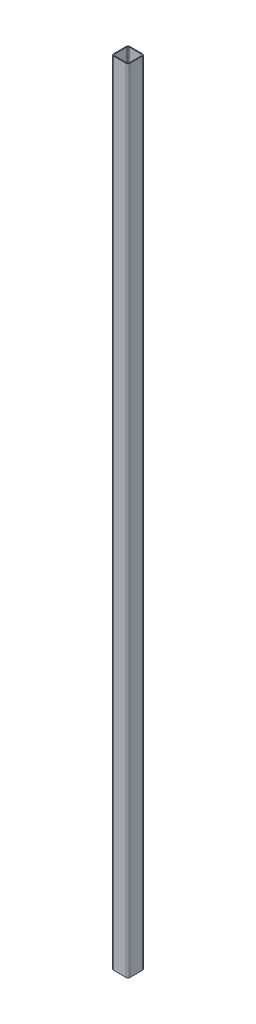
ISO-10303-21;
HEADER;
FILE_DESCRIPTION(('STEP AP214'),'2;1');
FILE_NAME('part.step','',(''),(''),'','','');
FILE_SCHEMA(('AUTOMOTIVE_DESIGN { 1 0 10303 214 1 1 1 1 }'));
ENDSEC;
DATA;
#1=APPLICATION_CONTEXT('core data for automotive mechanical design processes');
#2=APPLICATION_PROTOCOL_DEFINITION('international standard','automotive_design',2000,#1);
#3=PRODUCT_CONTEXT('',#1,'mechanical');
#4=PRODUCT('Part','Part','',(#3));
#5=PRODUCT_RELATED_PRODUCT_CATEGORY('part','',(#4));
#6=PRODUCT_DEFINITION_FORMATION('','',#4);
#7=PRODUCT_DEFINITION_CONTEXT('part definition',#1,'design');
#8=PRODUCT_DEFINITION('design','',#6,#7);
#9=PRODUCT_DEFINITION_SHAPE('','',#8);
#10=(LENGTH_UNIT() NAMED_UNIT(*) SI_UNIT(.MILLI.,.METRE.));
#11=(NAMED_UNIT(*) PLANE_ANGLE_UNIT() SI_UNIT($,.RADIAN.));
#12=(NAMED_UNIT(*) SI_UNIT($,.STERADIAN.) SOLID_ANGLE_UNIT());
#13=UNCERTAINTY_MEASURE_WITH_UNIT(LENGTH_MEASURE(1.E-05),#10,'distance_accuracy_value','');
#14=(GEOMETRIC_REPRESENTATION_CONTEXT(3) GLOBAL_UNCERTAINTY_ASSIGNED_CONTEXT((#13)) GLOBAL_UNIT_ASSIGNED_CONTEXT((#10,
#11,#12)) REPRESENTATION_CONTEXT('',''));
#15=CARTESIAN_POINT('',(0.,0.,0.));
#16=DIRECTION('',(0.,0.,1.));
#17=DIRECTION('',(1.,0.,0.));
#18=AXIS2_PLACEMENT_3D('',#15,#16,#17);
#19=CARTESIAN_POINT('',(-15.5,0.,-1064.5));
#20=DIRECTION('',(0.,1.,0.));
#21=DIRECTION('',(0.,0.,1.));
#22=AXIS2_PLACEMENT_3D('',#19,#20,#21);
#23=CYLINDRICAL_SURFACE('',#22,4.5);
#24=CARTESIAN_POINT('',(-15.5,1940.,-1064.5));
#25=DIRECTION('',(0.,1.,0.));
#26=DIRECTION('',(0.,0.,1.));
#27=AXIS2_PLACEMENT_3D('',#24,#25,#26);
#28=CIRCLE('',#27,4.5);
#29=CARTESIAN_POINT('',(-20.,1940.,-1064.5));
#30=VERTEX_POINT('',#29);
#31=CARTESIAN_POINT('',(-15.5,1940.,-1060.));
#32=VERTEX_POINT('',#31);
#33=EDGE_CURVE('E267',#30,#32,#28,.T.);
#34=ORIENTED_EDGE('',*,*,#33,.F.);
#35=DIRECTION('',(0.,1.,0.));
#36=VECTOR('',#35,1.);
#37=CARTESIAN_POINT('',(-20.,0.,-1064.5));
#38=LINE('',#37,#36);
#39=CARTESIAN_POINT('',(-20.,20.,-1064.5));
#40=VERTEX_POINT('',#39);
#41=EDGE_CURVE('E189',#40,#30,#38,.T.);
#42=ORIENTED_EDGE('',*,*,#41,.F.);
#43=CARTESIAN_POINT('',(-15.5,20.,-1064.5));
#44=DIRECTION('',(0.,-1.,0.));
#45=DIRECTION('',(0.,0.,-1.));
#46=AXIS2_PLACEMENT_3D('',#43,#44,#45);
#47=CIRCLE('',#46,4.5);
#48=CARTESIAN_POINT('',(-15.5,20.,-1060.));
#49=VERTEX_POINT('',#48);
#50=EDGE_CURVE('E299',#49,#40,#47,.T.);
#51=ORIENTED_EDGE('',*,*,#50,.F.);
#52=DIRECTION('',(0.,1.,0.));
#53=VECTOR('',#52,1.);
#54=CARTESIAN_POINT('',(-15.5,0.,-1060.));
#55=LINE('',#54,#53);
#56=EDGE_CURVE('E177',#49,#32,#55,.T.);
#57=ORIENTED_EDGE('',*,*,#56,.T.);
#58=EDGE_LOOP('',(#34,#42,#51,#57));
#59=FACE_BOUND('',#58,.T.);
#60=ADVANCED_FACE('F39',(#59),#23,.T.);
#61=CARTESIAN_POINT('',(-20.,0.,-1064.5));
#62=DIRECTION('',(1.,0.,0.));
#63=DIRECTION('',(0.,0.,-1.));
#64=AXIS2_PLACEMENT_3D('',#61,#62,#63);
#65=PLANE('',#64);
#66=DIRECTION('',(0.,0.,-1.));
#67=VECTOR('',#66,1.);
#68=CARTESIAN_POINT('',(-20.,1940.,0.));
#69=LINE('',#68,#67);
#70=CARTESIAN_POINT('',(-20.,1940.,-1095.5));
#71=VERTEX_POINT('',#70);
#72=EDGE_CURVE('E53',#30,#71,#69,.T.);
#73=ORIENTED_EDGE('',*,*,#72,.T.);
#74=DIRECTION('',(0.,1.,0.));
#75=VECTOR('',#74,1.);
#76=CARTESIAN_POINT('',(-20.,0.,-1095.5));
#77=LINE('',#76,#75);
#78=CARTESIAN_POINT('',(-20.,20.,-1095.5));
#79=VERTEX_POINT('',#78);
#80=EDGE_CURVE('E186',#79,#71,#77,.T.);
#81=ORIENTED_EDGE('',*,*,#80,.F.);
#82=DIRECTION('',(0.,0.,1.));
#83=VECTOR('',#82,1.);
#84=CARTESIAN_POINT('',(-20.,20.,-3240.));
#85=LINE('',#84,#83);
#86=EDGE_CURVE('E277',#79,#40,#85,.T.);
#87=ORIENTED_EDGE('',*,*,#86,.T.);
#88=ORIENTED_EDGE('',*,*,#41,.T.);
#89=EDGE_LOOP('',(#73,#81,#87,#88));
#90=FACE_BOUND('',#89,.T.);
#91=ADVANCED_FACE('F314',(#90),#65,.F.);
#92=CARTESIAN_POINT('',(-15.5,0.,-1095.5));
#93=DIRECTION('',(0.,1.,0.));
#94=DIRECTION('',(0.,0.,1.));
#95=AXIS2_PLACEMENT_3D('',#92,#93,#94);
#96=CYLINDRICAL_SURFACE('',#95,4.5);
#97=CARTESIAN_POINT('',(-15.5,1940.,-1095.5));
#98=DIRECTION('',(0.,1.,0.));
#99=DIRECTION('',(0.,0.,1.));
#100=AXIS2_PLACEMENT_3D('',#97,#98,#99);
#101=CIRCLE('',#100,4.5);
#102=CARTESIAN_POINT('',(-15.5,1940.,-1100.));
#103=VERTEX_POINT('',#102);
#104=EDGE_CURVE('E159',#103,#71,#101,.T.);
#105=ORIENTED_EDGE('',*,*,#104,.F.);
#106=DIRECTION('',(0.,1.,0.));
#107=VECTOR('',#106,1.);
#108=CARTESIAN_POINT('',(-15.5,0.,-1100.));
#109=LINE('',#108,#107);
#110=CARTESIAN_POINT('',(-15.5,20.,-1100.));
#111=VERTEX_POINT('',#110);
#112=EDGE_CURVE('E183',#111,#103,#109,.T.);
#113=ORIENTED_EDGE('',*,*,#112,.F.);
#114=CARTESIAN_POINT('',(-15.5,20.,-1095.5));
#115=DIRECTION('',(0.,-1.,0.));
#116=DIRECTION('',(0.,0.,-1.));
#117=AXIS2_PLACEMENT_3D('',#114,#115,#116);
#118=CIRCLE('',#117,4.5);
#119=EDGE_CURVE('E209',#79,#111,#118,.T.);
#120=ORIENTED_EDGE('',*,*,#119,.F.);
#121=ORIENTED_EDGE('',*,*,#80,.T.);
#122=EDGE_LOOP('',(#105,#113,#120,#121));
#123=FACE_BOUND('',#122,.T.);
#124=ADVANCED_FACE('F311',(#123),#96,.T.);
#125=CARTESIAN_POINT('',(-15.5,0.,-1100.));
#126=DIRECTION('',(0.,0.,1.));
#127=DIRECTION('',(1.,0.,0.));
#128=AXIS2_PLACEMENT_3D('',#125,#126,#127);
#129=PLANE('',#128);
#130=DIRECTION('',(-1.,0.,0.));
#131=VECTOR('',#130,1.);
#132=CARTESIAN_POINT('',(-15.5,1940.,-1100.));
#133=LINE('',#132,#131);
#134=CARTESIAN_POINT('',(15.5,1940.,-1100.));
#135=VERTEX_POINT('',#134);
#136=EDGE_CURVE('E271',#135,#103,#133,.T.);
#137=ORIENTED_EDGE('',*,*,#136,.F.);
#138=DIRECTION('',(0.,1.,0.));
#139=VECTOR('',#138,1.);
#140=CARTESIAN_POINT('',(15.5,0.,-1100.));
#141=LINE('',#140,#139);
#142=CARTESIAN_POINT('',(15.5,20.,-1100.));
#143=VERTEX_POINT('',#142);
#144=EDGE_CURVE('E175',#143,#135,#141,.T.);
#145=ORIENTED_EDGE('',*,*,#144,.F.);
#146=DIRECTION('',(1.,0.,0.));
#147=VECTOR('',#146,1.);
#148=CARTESIAN_POINT('',(-15.5,20.,-1100.));
#149=LINE('',#148,#147);
#150=EDGE_CURVE('E213',#111,#143,#149,.T.);
#151=ORIENTED_EDGE('',*,*,#150,.F.);
#152=ORIENTED_EDGE('',*,*,#112,.T.);
#153=EDGE_LOOP('',(#137,#145,#151,#152));
#154=FACE_BOUND('',#153,.T.);
#155=ADVANCED_FACE('F308',(#154),#129,.F.);
#156=CARTESIAN_POINT('',(15.5,0.,-1095.5));
#157=DIRECTION('',(0.,1.,0.));
#158=DIRECTION('',(0.,0.,1.));
#159=AXIS2_PLACEMENT_3D('',#156,#157,#158);
#160=CYLINDRICAL_SURFACE('',#159,4.5);
#161=CARTESIAN_POINT('',(15.5,1940.,-1095.5));
#162=DIRECTION('',(0.,1.,0.));
#163=DIRECTION('',(0.,0.,1.));
#164=AXIS2_PLACEMENT_3D('',#161,#162,#163);
#165=CIRCLE('',#164,4.5);
#166=CARTESIAN_POINT('',(20.,1940.,-1095.5));
#167=VERTEX_POINT('',#166);
#168=EDGE_CURVE('E273',#167,#135,#165,.T.);
#169=ORIENTED_EDGE('',*,*,#168,.F.);
#170=DIRECTION('',(0.,1.,0.));
#171=VECTOR('',#170,1.);
#172=CARTESIAN_POINT('',(20.,0.,-1095.5));
#173=LINE('',#172,#171);
#174=CARTESIAN_POINT('',(20.,20.,-1095.5));
#175=VERTEX_POINT('',#174);
#176=EDGE_CURVE('E168',#175,#167,#173,.T.);
#177=ORIENTED_EDGE('',*,*,#176,.F.);
#178=CARTESIAN_POINT('',(15.5,20.,-1095.5));
#179=DIRECTION('',(0.,-1.,0.));
#180=DIRECTION('',(0.,0.,-1.));
#181=AXIS2_PLACEMENT_3D('',#178,#179,#180);
#182=CIRCLE('',#181,4.5);
#183=EDGE_CURVE('E218',#143,#175,#182,.T.);
#184=ORIENTED_EDGE('',*,*,#183,.F.);
#185=ORIENTED_EDGE('',*,*,#144,.T.);
#186=EDGE_LOOP('',(#169,#177,#184,#185));
#187=FACE_BOUND('',#186,.T.);
#188=ADVANCED_FACE('F304',(#187),#160,.T.);
#189=CARTESIAN_POINT('',(20.,0.,-1064.5));
#190=DIRECTION('',(-1.,0.,0.));
#191=DIRECTION('',(0.,0.,1.));
#192=AXIS2_PLACEMENT_3D('',#189,#190,#191);
#193=PLANE('',#192);
#194=DIRECTION('',(0.,0.,-1.));
#195=VECTOR('',#194,1.);
#196=CARTESIAN_POINT('',(20.,1940.,0.));
#197=LINE('',#196,#195);
#198=CARTESIAN_POINT('',(20.,1940.,-1064.5));
#199=VERTEX_POINT('',#198);
#200=EDGE_CURVE('E151',#199,#167,#197,.T.);
#201=ORIENTED_EDGE('',*,*,#200,.F.);
#202=DIRECTION('',(0.,1.,0.));
#203=VECTOR('',#202,1.);
#204=CARTESIAN_POINT('',(20.,0.,-1064.5));
#205=LINE('',#204,#203);
#206=CARTESIAN_POINT('',(20.,20.,-1064.5));
#207=VERTEX_POINT('',#206);
#208=EDGE_CURVE('E166',#207,#199,#205,.T.);
#209=ORIENTED_EDGE('',*,*,#208,.F.);
#210=DIRECTION('',(0.,0.,1.));
#211=VECTOR('',#210,1.);
#212=CARTESIAN_POINT('',(20.,20.,-3240.));
#213=LINE('',#212,#211);
#214=EDGE_CURVE('E275',#175,#207,#213,.T.);
#215=ORIENTED_EDGE('',*,*,#214,.F.);
#216=ORIENTED_EDGE('',*,*,#176,.T.);
#217=EDGE_LOOP('',(#201,#209,#215,#216));
#218=FACE_BOUND('',#217,.T.);
#219=ADVANCED_FACE('F164',(#218),#193,.F.);
#220=CARTESIAN_POINT('',(15.5,0.,-1064.5));
#221=DIRECTION('',(0.,1.,0.));
#222=DIRECTION('',(0.,0.,1.));
#223=AXIS2_PLACEMENT_3D('',#220,#221,#222);
#224=CYLINDRICAL_SURFACE('',#223,4.5);
#225=CARTESIAN_POINT('',(15.5,1940.,-1064.5));
#226=DIRECTION('',(0.,1.,0.));
#227=DIRECTION('',(0.,0.,1.));
#228=AXIS2_PLACEMENT_3D('',#225,#226,#227);
#229=CIRCLE('',#228,4.5);
#230=CARTESIAN_POINT('',(15.5,1940.,-1060.));
#231=VERTEX_POINT('',#230);
#232=EDGE_CURVE('E148',#231,#199,#229,.T.);
#233=ORIENTED_EDGE('',*,*,#232,.F.);
#234=DIRECTION('',(0.,1.,0.));
#235=VECTOR('',#234,1.);
#236=CARTESIAN_POINT('',(15.5,0.,-1060.));
#237=LINE('',#236,#235);
#238=CARTESIAN_POINT('',(15.5,20.,-1060.));
#239=VERTEX_POINT('',#238);
#240=EDGE_CURVE('E173',#239,#231,#237,.T.);
#241=ORIENTED_EDGE('',*,*,#240,.F.);
#242=CARTESIAN_POINT('',(15.5,20.,-1064.5));
#243=DIRECTION('',(0.,-1.,0.));
#244=DIRECTION('',(0.,0.,-1.));
#245=AXIS2_PLACEMENT_3D('',#242,#243,#244);
#246=CIRCLE('',#245,4.5);
#247=EDGE_CURVE('E172',#207,#239,#246,.T.);
#248=ORIENTED_EDGE('',*,*,#247,.F.);
#249=ORIENTED_EDGE('',*,*,#208,.T.);
#250=EDGE_LOOP('',(#233,#241,#248,#249));
#251=FACE_BOUND('',#250,.T.);
#252=ADVANCED_FACE('F171',(#251),#224,.T.);
#253=CARTESIAN_POINT('',(-15.5,0.,-1060.));
#254=DIRECTION('',(0.,0.,-1.));
#255=DIRECTION('',(-1.,0.,0.));
#256=AXIS2_PLACEMENT_3D('',#253,#254,#255);
#257=PLANE('',#256);
#258=DIRECTION('',(1.,0.,0.));
#259=VECTOR('',#258,1.);
#260=CARTESIAN_POINT('',(-15.5,1940.,-1060.));
#261=LINE('',#260,#259);
#262=EDGE_CURVE('E154',#32,#231,#261,.T.);
#263=ORIENTED_EDGE('',*,*,#262,.F.);
#264=ORIENTED_EDGE('',*,*,#56,.F.);
#265=DIRECTION('',(-1.,0.,0.));
#266=VECTOR('',#265,1.);
#267=CARTESIAN_POINT('',(-15.5,20.,-1060.));
#268=LINE('',#267,#266);
#269=EDGE_CURVE('E296',#239,#49,#268,.T.);
#270=ORIENTED_EDGE('',*,*,#269,.F.);
#271=ORIENTED_EDGE('',*,*,#240,.T.);
#272=EDGE_LOOP('',(#263,#264,#270,#271));
#273=FACE_BOUND('',#272,.T.);
#274=ADVANCED_FACE('F317',(#273),#257,.F.);
#275=CARTESIAN_POINT('',(-15.5,20.,-3240.));
#276=DIRECTION('',(0.,-1.,0.));
#277=DIRECTION('',(0.,0.,-1.));
#278=AXIS2_PLACEMENT_3D('',#275,#276,#277);
#279=PLANE('',#278);
#280=DIRECTION('',(-1.,0.,0.));
#281=VECTOR('',#280,1.);
#282=CARTESIAN_POINT('',(-15.,20.,-1062.));
#283=LINE('',#282,#281);
#284=CARTESIAN_POINT('',(15.,20.,-1062.));
#285=VERTEX_POINT('',#284);
#286=CARTESIAN_POINT('',(-15.,20.,-1062.));
#287=VERTEX_POINT('',#286);
#288=EDGE_CURVE('E291',#285,#287,#283,.T.);
#289=ORIENTED_EDGE('',*,*,#288,.F.);
#290=CARTESIAN_POINT('',(15.,20.,-1065.));
#291=DIRECTION('',(0.,-1.,0.));
#292=DIRECTION('',(0.,0.,-1.));
#293=AXIS2_PLACEMENT_3D('',#290,#291,#292);
#294=CIRCLE('',#293,3.);
#295=CARTESIAN_POINT('',(18.,20.,-1065.));
#296=VERTEX_POINT('',#295);
#297=EDGE_CURVE('E247',#296,#285,#294,.T.);
#298=ORIENTED_EDGE('',*,*,#297,.F.);
#299=DIRECTION('',(0.,0.,1.));
#300=VECTOR('',#299,1.);
#301=CARTESIAN_POINT('',(18.,20.,-1065.));
#302=LINE('',#301,#300);
#303=CARTESIAN_POINT('',(18.,20.,-1095.));
#304=VERTEX_POINT('',#303);
#305=EDGE_CURVE('E242',#304,#296,#302,.T.);
#306=ORIENTED_EDGE('',*,*,#305,.F.);
#307=CARTESIAN_POINT('',(15.,20.,-1095.));
#308=DIRECTION('',(0.,-1.,0.));
#309=DIRECTION('',(0.,0.,-1.));
#310=AXIS2_PLACEMENT_3D('',#307,#308,#309);
#311=CIRCLE('',#310,3.);
#312=CARTESIAN_POINT('',(15.,20.,-1098.));
#313=VERTEX_POINT('',#312);
#314=EDGE_CURVE('E286',#313,#304,#311,.T.);
#315=ORIENTED_EDGE('',*,*,#314,.F.);
#316=DIRECTION('',(1.,0.,0.));
#317=VECTOR('',#316,1.);
#318=CARTESIAN_POINT('',(-15.,20.,-1098.));
#319=LINE('',#318,#317);
#320=CARTESIAN_POINT('',(-15.,20.,-1098.));
#321=VERTEX_POINT('',#320);
#322=EDGE_CURVE('E283',#321,#313,#319,.T.);
#323=ORIENTED_EDGE('',*,*,#322,.F.);
#324=CARTESIAN_POINT('',(-15.,20.,-1095.));
#325=DIRECTION('',(0.,-1.,0.));
#326=DIRECTION('',(0.,0.,-1.));
#327=AXIS2_PLACEMENT_3D('',#324,#325,#326);
#328=CIRCLE('',#327,3.);
#329=CARTESIAN_POINT('',(-18.,20.,-1095.));
#330=VERTEX_POINT('',#329);
#331=EDGE_CURVE('E280',#330,#321,#328,.T.);
#332=ORIENTED_EDGE('',*,*,#331,.F.);
#333=DIRECTION('',(0.,0.,-1.));
#334=VECTOR('',#333,1.);
#335=CARTESIAN_POINT('',(-18.,20.,-1065.));
#336=LINE('',#335,#334);
#337=CARTESIAN_POINT('',(-18.,20.,-1065.));
#338=VERTEX_POINT('',#337);
#339=EDGE_CURVE('E46',#338,#330,#336,.T.);
#340=ORIENTED_EDGE('',*,*,#339,.F.);
#341=CARTESIAN_POINT('',(-15.,20.,-1065.));
#342=DIRECTION('',(0.,-1.,0.));
#343=DIRECTION('',(0.,0.,-1.));
#344=AXIS2_PLACEMENT_3D('',#341,#342,#343);
#345=CIRCLE('',#344,3.);
#346=EDGE_CURVE('E293',#287,#338,#345,.T.);
#347=ORIENTED_EDGE('',*,*,#346,.F.);
#348=EDGE_LOOP('',(#289,#298,#306,#315,#323,#332,#340,#347));
#349=FACE_BOUND('',#348,.T.);
#350=ORIENTED_EDGE('',*,*,#119,.T.);
#351=ORIENTED_EDGE('',*,*,#150,.T.);
#352=ORIENTED_EDGE('',*,*,#183,.T.);
#353=ORIENTED_EDGE('',*,*,#214,.T.);
#354=ORIENTED_EDGE('',*,*,#247,.T.);
#355=ORIENTED_EDGE('',*,*,#269,.T.);
#356=ORIENTED_EDGE('',*,*,#50,.T.);
#357=ORIENTED_EDGE('',*,*,#86,.F.);
#358=EDGE_LOOP('',(#350,#351,#352,#353,#354,#355,#356,#357));
#359=FACE_BOUND('',#358,.T.);
#360=ADVANCED_FACE('F301',(#349,#359),#279,.T.);
#361=CARTESIAN_POINT('',(-15.,0.,-1065.));
#362=DIRECTION('',(0.,1.,0.));
#363=DIRECTION('',(0.,0.,1.));
#364=AXIS2_PLACEMENT_3D('',#361,#362,#363);
#365=CYLINDRICAL_SURFACE('',#364,3.);
#366=DIRECTION('',(0.,1.,0.));
#367=VECTOR('',#366,1.);
#368=CARTESIAN_POINT('',(-18.,0.,-1065.));
#369=LINE('',#368,#367);
#370=CARTESIAN_POINT('',(-18.,1940.,-1065.));
#371=VERTEX_POINT('',#370);
#372=EDGE_CURVE('E191',#338,#371,#369,.T.);
#373=ORIENTED_EDGE('',*,*,#372,.T.);
#374=CARTESIAN_POINT('',(-15.,1940.,-1065.));
#375=DIRECTION('',(0.,1.,0.));
#376=DIRECTION('',(0.,0.,1.));
#377=AXIS2_PLACEMENT_3D('',#374,#375,#376);
#378=CIRCLE('',#377,3.);
#379=CARTESIAN_POINT('',(-15.,1940.,-1062.));
#380=VERTEX_POINT('',#379);
#381=EDGE_CURVE('E11',#371,#380,#378,.T.);
#382=ORIENTED_EDGE('',*,*,#381,.T.);
#383=DIRECTION('',(0.,1.,0.));
#384=VECTOR('',#383,1.);
#385=CARTESIAN_POINT('',(-15.,0.,-1062.));
#386=LINE('',#385,#384);
#387=EDGE_CURVE('E193',#287,#380,#386,.T.);
#388=ORIENTED_EDGE('',*,*,#387,.F.);
#389=ORIENTED_EDGE('',*,*,#346,.T.);
#390=EDGE_LOOP('',(#373,#382,#388,#389));
#391=FACE_BOUND('',#390,.T.);
#392=ADVANCED_FACE('F326',(#391),#365,.F.);
#393=CARTESIAN_POINT('',(-15.,0.,-1062.));
#394=DIRECTION('',(0.,0.,-1.));
#395=DIRECTION('',(-1.,0.,0.));
#396=AXIS2_PLACEMENT_3D('',#393,#394,#395);
#397=PLANE('',#396);
#398=ORIENTED_EDGE('',*,*,#387,.T.);
#399=DIRECTION('',(1.,0.,0.));
#400=VECTOR('',#399,1.);
#401=CARTESIAN_POINT('',(-15.,1940.,-1062.));
#402=LINE('',#401,#400);
#403=CARTESIAN_POINT('',(15.,1940.,-1062.));
#404=VERTEX_POINT('',#403);
#405=EDGE_CURVE('E61',#380,#404,#402,.T.);
#406=ORIENTED_EDGE('',*,*,#405,.T.);
#407=DIRECTION('',(0.,1.,0.));
#408=VECTOR('',#407,1.);
#409=CARTESIAN_POINT('',(15.,0.,-1062.));
#410=LINE('',#409,#408);
#411=EDGE_CURVE('E199',#285,#404,#410,.T.);
#412=ORIENTED_EDGE('',*,*,#411,.F.);
#413=ORIENTED_EDGE('',*,*,#288,.T.);
#414=EDGE_LOOP('',(#398,#406,#412,#413));
#415=FACE_BOUND('',#414,.T.);
#416=ADVANCED_FACE('F391',(#415),#397,.T.);
#417=CARTESIAN_POINT('',(15.,0.,-1065.));
#418=DIRECTION('',(0.,1.,0.));
#419=DIRECTION('',(0.,0.,1.));
#420=AXIS2_PLACEMENT_3D('',#417,#418,#419);
#421=CYLINDRICAL_SURFACE('',#420,3.);
#422=ORIENTED_EDGE('',*,*,#411,.T.);
#423=CARTESIAN_POINT('',(15.,1940.,-1065.));
#424=DIRECTION('',(0.,1.,0.));
#425=DIRECTION('',(0.,0.,1.));
#426=AXIS2_PLACEMENT_3D('',#423,#424,#425);
#427=CIRCLE('',#426,3.);
#428=CARTESIAN_POINT('',(18.,1940.,-1065.));
#429=VERTEX_POINT('',#428);
#430=EDGE_CURVE('E249',#404,#429,#427,.T.);
#431=ORIENTED_EDGE('',*,*,#430,.T.);
#432=DIRECTION('',(0.,1.,0.));
#433=VECTOR('',#432,1.);
#434=CARTESIAN_POINT('',(18.,0.,-1065.));
#435=LINE('',#434,#433);
#436=EDGE_CURVE('E205',#296,#429,#435,.T.);
#437=ORIENTED_EDGE('',*,*,#436,.F.);
#438=ORIENTED_EDGE('',*,*,#297,.T.);
#439=EDGE_LOOP('',(#422,#431,#437,#438));
#440=FACE_BOUND('',#439,.T.);
#441=ADVANCED_FACE('F246',(#440),#421,.F.);
#442=CARTESIAN_POINT('',(18.,0.,-1065.));
#443=DIRECTION('',(-1.,0.,0.));
#444=DIRECTION('',(0.,0.,1.));
#445=AXIS2_PLACEMENT_3D('',#442,#443,#444);
#446=PLANE('',#445);
#447=ORIENTED_EDGE('',*,*,#436,.T.);
#448=DIRECTION('',(0.,0.,-1.));
#449=VECTOR('',#448,1.);
#450=CARTESIAN_POINT('',(18.,1940.,-1065.));
#451=LINE('',#450,#449);
#452=CARTESIAN_POINT('',(18.,1940.,-1095.));
#453=VERTEX_POINT('',#452);
#454=EDGE_CURVE('E241',#429,#453,#451,.T.);
#455=ORIENTED_EDGE('',*,*,#454,.T.);
#456=DIRECTION('',(0.,1.,0.));
#457=VECTOR('',#456,1.);
#458=CARTESIAN_POINT('',(18.,0.,-1095.));
#459=LINE('',#458,#457);
#460=EDGE_CURVE('E232',#304,#453,#459,.T.);
#461=ORIENTED_EDGE('',*,*,#460,.F.);
#462=ORIENTED_EDGE('',*,*,#305,.T.);
#463=EDGE_LOOP('',(#447,#455,#461,#462));
#464=FACE_BOUND('',#463,.T.);
#465=ADVANCED_FACE('F239',(#464),#446,.T.);
#466=CARTESIAN_POINT('',(15.,0.,-1095.));
#467=DIRECTION('',(0.,1.,0.));
#468=DIRECTION('',(0.,0.,1.));
#469=AXIS2_PLACEMENT_3D('',#466,#467,#468);
#470=CYLINDRICAL_SURFACE('',#469,3.);
#471=ORIENTED_EDGE('',*,*,#460,.T.);
#472=CARTESIAN_POINT('',(15.,1940.,-1095.));
#473=DIRECTION('',(0.,1.,0.));
#474=DIRECTION('',(0.,0.,1.));
#475=AXIS2_PLACEMENT_3D('',#472,#473,#474);
#476=CIRCLE('',#475,3.);
#477=CARTESIAN_POINT('',(15.,1940.,-1098.));
#478=VERTEX_POINT('',#477);
#479=EDGE_CURVE('E251',#453,#478,#476,.T.);
#480=ORIENTED_EDGE('',*,*,#479,.T.);
#481=DIRECTION('',(0.,1.,0.));
#482=VECTOR('',#481,1.);
#483=CARTESIAN_POINT('',(15.,0.,-1098.));
#484=LINE('',#483,#482);
#485=EDGE_CURVE('E229',#313,#478,#484,.T.);
#486=ORIENTED_EDGE('',*,*,#485,.F.);
#487=ORIENTED_EDGE('',*,*,#314,.T.);
#488=EDGE_LOOP('',(#471,#480,#486,#487));
#489=FACE_BOUND('',#488,.T.);
#490=ADVANCED_FACE('F410',(#489),#470,.F.);
#491=CARTESIAN_POINT('',(-15.,0.,-1098.));
#492=DIRECTION('',(0.,0.,1.));
#493=DIRECTION('',(1.,0.,0.));
#494=AXIS2_PLACEMENT_3D('',#491,#492,#493);
#495=PLANE('',#494);
#496=ORIENTED_EDGE('',*,*,#485,.T.);
#497=DIRECTION('',(-1.,0.,0.));
#498=VECTOR('',#497,1.);
#499=CARTESIAN_POINT('',(-15.,1940.,-1098.));
#500=LINE('',#499,#498);
#501=CARTESIAN_POINT('',(-15.,1940.,-1098.));
#502=VERTEX_POINT('',#501);
#503=EDGE_CURVE('E258',#478,#502,#500,.T.);
#504=ORIENTED_EDGE('',*,*,#503,.T.);
#505=DIRECTION('',(0.,1.,0.));
#506=VECTOR('',#505,1.);
#507=CARTESIAN_POINT('',(-15.,0.,-1098.));
#508=LINE('',#507,#506);
#509=EDGE_CURVE('E226',#321,#502,#508,.T.);
#510=ORIENTED_EDGE('',*,*,#509,.F.);
#511=ORIENTED_EDGE('',*,*,#322,.T.);
#512=EDGE_LOOP('',(#496,#504,#510,#511));
#513=FACE_BOUND('',#512,.T.);
#514=ADVANCED_FACE('F417',(#513),#495,.T.);
#515=CARTESIAN_POINT('',(-15.,0.,-1095.));
#516=DIRECTION('',(0.,1.,0.));
#517=DIRECTION('',(0.,0.,1.));
#518=AXIS2_PLACEMENT_3D('',#515,#516,#517);
#519=CYLINDRICAL_SURFACE('',#518,3.);
#520=ORIENTED_EDGE('',*,*,#509,.T.);
#521=CARTESIAN_POINT('',(-15.,1940.,-1095.));
#522=DIRECTION('',(0.,1.,0.));
#523=DIRECTION('',(0.,0.,1.));
#524=AXIS2_PLACEMENT_3D('',#521,#522,#523);
#525=CIRCLE('',#524,3.);
#526=CARTESIAN_POINT('',(-18.,1940.,-1095.));
#527=VERTEX_POINT('',#526);
#528=EDGE_CURVE('E261',#502,#527,#525,.T.);
#529=ORIENTED_EDGE('',*,*,#528,.T.);
#530=DIRECTION('',(0.,1.,0.));
#531=VECTOR('',#530,1.);
#532=CARTESIAN_POINT('',(-18.,0.,-1095.));
#533=LINE('',#532,#531);
#534=EDGE_CURVE('E224',#330,#527,#533,.T.);
#535=ORIENTED_EDGE('',*,*,#534,.F.);
#536=ORIENTED_EDGE('',*,*,#331,.T.);
#537=EDGE_LOOP('',(#520,#529,#535,#536));
#538=FACE_BOUND('',#537,.T.);
#539=ADVANCED_FACE('F425',(#538),#519,.F.);
#540=CARTESIAN_POINT('',(-18.,0.,-1065.));
#541=DIRECTION('',(1.,0.,0.));
#542=DIRECTION('',(0.,0.,-1.));
#543=AXIS2_PLACEMENT_3D('',#540,#541,#542);
#544=PLANE('',#543);
#545=ORIENTED_EDGE('',*,*,#534,.T.);
#546=DIRECTION('',(0.,0.,1.));
#547=VECTOR('',#546,1.);
#548=CARTESIAN_POINT('',(-18.,1940.,-1065.));
#549=LINE('',#548,#547);
#550=EDGE_CURVE('E264',#527,#371,#549,.T.);
#551=ORIENTED_EDGE('',*,*,#550,.T.);
#552=ORIENTED_EDGE('',*,*,#372,.F.);
#553=ORIENTED_EDGE('',*,*,#339,.T.);
#554=EDGE_LOOP('',(#545,#551,#552,#553));
#555=FACE_BOUND('',#554,.T.);
#556=ADVANCED_FACE('F433',(#555),#544,.T.);
#557=CARTESIAN_POINT('',(-15.5,1940.,0.));
#558=DIRECTION('',(0.,1.,0.));
#559=DIRECTION('',(0.,0.,1.));
#560=AXIS2_PLACEMENT_3D('',#557,#558,#559);
#561=PLANE('',#560);
#562=ORIENTED_EDGE('',*,*,#528,.F.);
#563=ORIENTED_EDGE('',*,*,#503,.F.);
#564=ORIENTED_EDGE('',*,*,#479,.F.);
#565=ORIENTED_EDGE('',*,*,#454,.F.);
#566=ORIENTED_EDGE('',*,*,#430,.F.);
#567=ORIENTED_EDGE('',*,*,#405,.F.);
#568=ORIENTED_EDGE('',*,*,#381,.F.);
#569=ORIENTED_EDGE('',*,*,#550,.F.);
#570=EDGE_LOOP('',(#562,#563,#564,#565,#566,#567,#568,#569));
#571=FACE_BOUND('',#570,.T.);
#572=ORIENTED_EDGE('',*,*,#168,.T.);
#573=ORIENTED_EDGE('',*,*,#136,.T.);
#574=ORIENTED_EDGE('',*,*,#104,.T.);
#575=ORIENTED_EDGE('',*,*,#72,.F.);
#576=ORIENTED_EDGE('',*,*,#33,.T.);
#577=ORIENTED_EDGE('',*,*,#262,.T.);
#578=ORIENTED_EDGE('',*,*,#232,.T.);
#579=ORIENTED_EDGE('',*,*,#200,.T.);
#580=EDGE_LOOP('',(#572,#573,#574,#575,#576,#577,#578,#579));
#581=FACE_BOUND('',#580,.T.);
#582=ADVANCED_FACE('F150',(#571,#581),#561,.T.);
#583=CLOSED_SHELL('',(#60,#91,#124,#155,#188,#219,#252,#274,#360,#392,#416,#441,#465,#490,#514,
#539,#556,#582));
#584=MANIFOLD_SOLID_BREP('B2',#583);
#585=ADVANCED_BREP_SHAPE_REPRESENTATION('',(#18,#584),#14);
#586=SHAPE_DEFINITION_REPRESENTATION(#9,#585);
ENDSEC;
END-ISO-10303-21;
